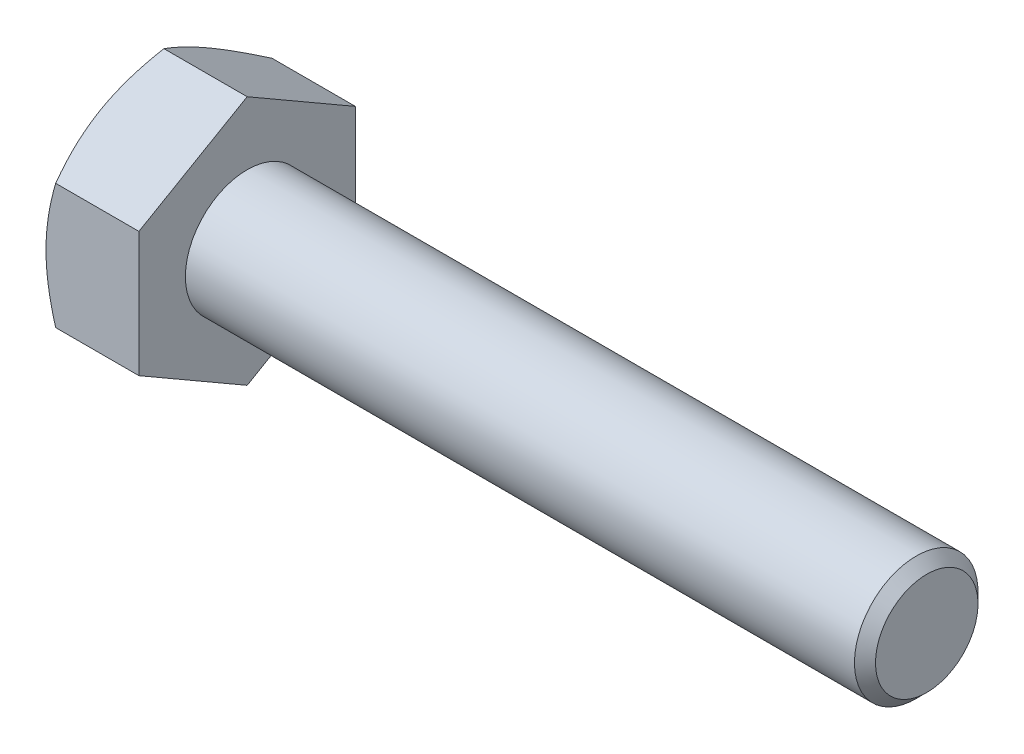
ISO-10303-21;
HEADER;
FILE_DESCRIPTION(('STEP AP214'),'2;1');
FILE_NAME('part.step','',(''),(''),'','','');
FILE_SCHEMA(('AUTOMOTIVE_DESIGN { 1 0 10303 214 1 1 1 1 }'));
ENDSEC;
DATA;
#1=APPLICATION_CONTEXT('core data for automotive mechanical design processes');
#2=APPLICATION_PROTOCOL_DEFINITION('international standard','automotive_design',2000,#1);
#3=PRODUCT_CONTEXT('',#1,'mechanical');
#4=PRODUCT('Part','Part','',(#3));
#5=PRODUCT_RELATED_PRODUCT_CATEGORY('part','',(#4));
#6=PRODUCT_DEFINITION_FORMATION('','',#4);
#7=PRODUCT_DEFINITION_CONTEXT('part definition',#1,'design');
#8=PRODUCT_DEFINITION('design','',#6,#7);
#9=PRODUCT_DEFINITION_SHAPE('','',#8);
#10=(LENGTH_UNIT() NAMED_UNIT(*) SI_UNIT(.MILLI.,.METRE.));
#11=(NAMED_UNIT(*) PLANE_ANGLE_UNIT() SI_UNIT($,.RADIAN.));
#12=(NAMED_UNIT(*) SI_UNIT($,.STERADIAN.) SOLID_ANGLE_UNIT());
#13=UNCERTAINTY_MEASURE_WITH_UNIT(LENGTH_MEASURE(1.E-05),#10,'distance_accuracy_value','');
#14=(GEOMETRIC_REPRESENTATION_CONTEXT(3) GLOBAL_UNCERTAINTY_ASSIGNED_CONTEXT((#13)) GLOBAL_UNIT_ASSIGNED_CONTEXT((#10,
#11,#12)) REPRESENTATION_CONTEXT('',''));
#15=CARTESIAN_POINT('',(0.,0.,0.));
#16=DIRECTION('',(0.,0.,1.));
#17=DIRECTION('',(1.,0.,0.));
#18=AXIS2_PLACEMENT_3D('',#15,#16,#17);
#19=CARTESIAN_POINT('',(4.7752,3.21156860739421,-5.5626));
#20=DIRECTION('',(0.,-0.866025403784438,0.500000000000001));
#21=DIRECTION('',(0.,-0.500000000000001,-0.866025403784438));
#22=AXIS2_PLACEMENT_3D('',#19,#20,#21);
#23=PLANE('',#22);
#24=CARTESIAN_POINT('',(0.496898061070143,6.42325268484227,0.0002));
#25=CARTESIAN_POINT('',(0.45614620225513,6.35265858120791,-0.122072574209491));
#26=CARTESIAN_POINT('',(0.417243775308723,6.2818012683745,-0.244801040124762));
#27=CARTESIAN_POINT('',(0.343647161560542,6.13951120287093,-0.491254662989243));
#28=CARTESIAN_POINT('',(0.308954790139044,6.06807821602765,-0.614980225538197));
#29=CARTESIAN_POINT('',(0.211873701066855,5.85263550648139,-0.98813794459262));
#30=CARTESIAN_POINT('',(0.156654841923373,5.70777535201369,-1.23904309212296));
#31=CARTESIAN_POINT('',(0.0919037861815275,5.49099476252075,-1.61451808721946));
#32=CARTESIAN_POINT('',(0.0734579983429333,5.41972205873199,-1.7379660313744));
#33=CARTESIAN_POINT('',(0.0425268916674615,5.27685459691414,-1.98541973399132));
#34=CARTESIAN_POINT('',(0.030041046189008,5.20525986790488,-2.10942544218948));
#35=CARTESIAN_POINT('',(0.0113480299394708,5.06194605565757,-2.35765224642821));
#36=CARTESIAN_POINT('',(0.00513373340584708,4.9902272065059,-2.48187293701928));
#37=CARTESIAN_POINT('',(-0.000889599359095551,4.84672720555795,-2.7304222295473));
#38=CARTESIAN_POINT('',(-0.000698833448296274,4.7749460557547,-2.85475082803225));
#39=CARTESIAN_POINT('',(0.00862810136342285,4.57828637012706,-3.19537539533985));
#40=CARTESIAN_POINT('',(0.0242873955350757,4.4534722013835,-3.41155987710816));
#41=CARTESIAN_POINT('',(0.0739443233816052,4.20467287416474,-3.84249295274001));
#42=CARTESIAN_POINT('',(0.107958931423458,4.08068859075412,-4.05724003094723));
#43=CARTESIAN_POINT('',(0.192986041409677,3.83138850679899,-4.4890404426887));
#44=CARTESIAN_POINT('',(0.244358813937401,3.70610416511176,-4.70603928788379));
#45=CARTESIAN_POINT('',(0.360954456999593,3.45740388365365,-5.13680081122592));
#46=CARTESIAN_POINT('',(0.426149937617058,3.33398475856357,-5.35056900650764));
#47=CARTESIAN_POINT('',(0.496898061070137,3.21145313734037,-5.5628));
#48=B_SPLINE_CURVE_WITH_KNOTS('',3,(#24,#25,#26,#27,#28,#29,#30,#31,#32,#33,#34,#35,#36,#37,#38,
#39,#40,#41,#42,#43,#44,#45,#46,#47),.UNSPECIFIED.,.F.,.F.,(4,2,2,2,2,2,2,2,2,2,2,4),(0.,
0.44082011856227,0.8818296488474,1.76568130465017,2.19678242164486,2.62784543796583,
3.05841812523868,3.48897751176353,4.23854798324166,4.98881282275669,5.75571809391027,
6.52111769989992),.UNSPECIFIED.);
#49=CARTESIAN_POINT('',(0.496831392605788,6.42313721478843,0.));
#50=VERTEX_POINT('',#49);
#51=CARTESIAN_POINT('',(0.,4.81735291109131,-2.78130000000001));
#52=VERTEX_POINT('',#51);
#53=EDGE_CURVE('E52',#50,#52,#48,.T.);
#54=ORIENTED_EDGE('',*,*,#53,.F.);
#55=DIRECTION('',(-1.,0.,0.));
#56=VECTOR('',#55,1.);
#57=CARTESIAN_POINT('',(4.7752,6.42313721478843,0.));
#58=LINE('',#57,#56);
#59=CARTESIAN_POINT('',(4.7752,6.42313721478843,0.));
#60=VERTEX_POINT('',#59);
#61=EDGE_CURVE('E148',#60,#50,#58,.T.);
#62=ORIENTED_EDGE('',*,*,#61,.F.);
#63=DIRECTION('',(0.,0.500000000000001,0.866025403784438));
#64=VECTOR('',#63,1.);
#65=CARTESIAN_POINT('',(4.7752,3.21156860739421,-5.5626));
#66=LINE('',#65,#64);
#67=CARTESIAN_POINT('',(4.7752,3.21156860739421,-5.5626));
#68=VERTEX_POINT('',#67);
#69=EDGE_CURVE('E239',#68,#60,#66,.T.);
#70=ORIENTED_EDGE('',*,*,#69,.F.);
#71=DIRECTION('',(-1.,0.,0.));
#72=VECTOR('',#71,1.);
#73=CARTESIAN_POINT('',(4.7752,3.21156860739421,-5.5626));
#74=LINE('',#73,#72);
#75=CARTESIAN_POINT('',(0.496831392605783,3.21156860739421,-5.5626));
#76=VERTEX_POINT('',#75);
#77=EDGE_CURVE('E136',#68,#76,#74,.T.);
#78=ORIENTED_EDGE('',*,*,#77,.T.);
#79=EDGE_CURVE('E130',#52,#76,#48,.T.);
#80=ORIENTED_EDGE('',*,*,#79,.F.);
#81=EDGE_LOOP('',(#54,#62,#70,#78,#80));
#82=FACE_BOUND('',#81,.T.);
#83=ADVANCED_FACE('F36',(#82),#23,.F.);
#84=CARTESIAN_POINT('',(4.7752,6.42313721478843,0.));
#85=DIRECTION('',(0.,-0.866025403784438,-0.500000000000001));
#86=DIRECTION('',(0.,0.500000000000001,-0.866025403784438));
#87=AXIS2_PLACEMENT_3D('',#84,#85,#86);
#88=PLANE('',#87);
#89=CARTESIAN_POINT('',(0.496898061070137,3.21145313734037,5.5628));
#90=CARTESIAN_POINT('',(0.456146202255125,3.28204724097473,5.44052742579051));
#91=CARTESIAN_POINT('',(0.417243775308718,3.35290455380814,5.31779895987524));
#92=CARTESIAN_POINT('',(0.343647161560538,3.49519461931171,5.07134533701076));
#93=CARTESIAN_POINT('',(0.30895479013904,3.56662760615498,4.9476197744618));
#94=CARTESIAN_POINT('',(0.211873701066851,3.78207031570124,4.57446205540738));
#95=CARTESIAN_POINT('',(0.15665484192337,3.92693047016895,4.32355690787704));
#96=CARTESIAN_POINT('',(0.0919037861815256,4.14371105966188,3.94808191278055));
#97=CARTESIAN_POINT('',(0.0734579983429316,4.21498376345064,3.82463396862561));
#98=CARTESIAN_POINT('',(0.0425268916674604,4.35785122526849,3.57718026600868));
#99=CARTESIAN_POINT('',(0.0300410461890073,4.42944595427775,3.45317455781052));
#100=CARTESIAN_POINT('',(0.0113480299394703,4.57275976652506,3.20494775357179));
#101=CARTESIAN_POINT('',(0.00513373340584622,4.64447861567673,3.08072706298073));
#102=CARTESIAN_POINT('',(-0.000889599359096195,4.78797861662468,2.8321777704527));
#103=CARTESIAN_POINT('',(-0.000698833448296402,4.85975976642794,2.70784917196775));
#104=CARTESIAN_POINT('',(0.00862810136342377,5.05641945205558,2.36722460466016));
#105=CARTESIAN_POINT('',(0.0242873955350769,5.18123362079913,2.15104012289184));
#106=CARTESIAN_POINT('',(0.0739443233816068,5.4300329480179,1.72010704725999));
#107=CARTESIAN_POINT('',(0.10795893142346,5.55401723142852,1.50535996905278));
#108=CARTESIAN_POINT('',(0.192986041409679,5.80331731538365,1.0735595573113));
#109=CARTESIAN_POINT('',(0.244358813937404,5.92860165707088,0.856560712116214));
#110=CARTESIAN_POINT('',(0.360954456999597,6.17730193852899,0.425799188774084));
#111=CARTESIAN_POINT('',(0.426149937617063,6.30072106361907,0.212030993492363));
#112=CARTESIAN_POINT('',(0.496898061070142,6.42325268484227,-0.000199999999999788));
#113=B_SPLINE_CURVE_WITH_KNOTS('',3,(#89,#90,#91,#92,#93,#94,#95,#96,#97,#98,#99,#100,#101,#102,
#103,#104,#105,#106,#107,#108,#109,#110,#111,#112),.UNSPECIFIED.,.F.,.F.,(4,2,2,2,2,2,2,2,2,2,2,
4),(0.,0.440820118562269,0.881829648847399,1.76568130465016,2.19678242164486,2.62784543796583,
3.05841812523867,3.48897751176352,4.23854798324166,4.98881282275669,5.75571809391027,
6.52111769989992),.UNSPECIFIED.);
#114=CARTESIAN_POINT('',(0.496831392605783,3.21156860739421,5.5626));
#115=VERTEX_POINT('',#114);
#116=CARTESIAN_POINT('',(0.,4.81735291109131,2.78130000000001));
#117=VERTEX_POINT('',#116);
#118=EDGE_CURVE('E59',#115,#117,#113,.T.);
#119=ORIENTED_EDGE('',*,*,#118,.F.);
#120=DIRECTION('',(-1.,0.,0.));
#121=VECTOR('',#120,1.);
#122=CARTESIAN_POINT('',(4.7752,3.21156860739421,5.5626));
#123=LINE('',#122,#121);
#124=CARTESIAN_POINT('',(4.7752,3.21156860739421,5.5626));
#125=VERTEX_POINT('',#124);
#126=EDGE_CURVE('E146',#125,#115,#123,.T.);
#127=ORIENTED_EDGE('',*,*,#126,.F.);
#128=DIRECTION('',(0.,-0.500000000000001,0.866025403784438));
#129=VECTOR('',#128,1.);
#130=CARTESIAN_POINT('',(4.7752,6.42313721478843,0.));
#131=LINE('',#130,#129);
#132=EDGE_CURVE('E237',#60,#125,#131,.T.);
#133=ORIENTED_EDGE('',*,*,#132,.F.);
#134=ORIENTED_EDGE('',*,*,#61,.T.);
#135=EDGE_CURVE('E163',#117,#50,#113,.T.);
#136=ORIENTED_EDGE('',*,*,#135,.F.);
#137=EDGE_LOOP('',(#119,#127,#133,#134,#136));
#138=FACE_BOUND('',#137,.T.);
#139=ADVANCED_FACE('F169',(#138),#88,.F.);
#140=CARTESIAN_POINT('',(4.7752,3.21156860739421,5.5626));
#141=DIRECTION('',(0.,0.,-1.));
#142=DIRECTION('',(0.,1.,0.));
#143=AXIS2_PLACEMENT_3D('',#140,#141,#142);
#144=PLANE('',#143);
#145=CARTESIAN_POINT('',(2.76946298118782,-8.73931907134927,5.5626));
#146=CARTESIAN_POINT('',(2.65067477687312,-8.49536496294497,5.5626));
#147=CARTESIAN_POINT('',(2.53299354297043,-8.25086273134793,5.5626));
#148=CARTESIAN_POINT('',(2.30046552320844,-7.76047089715342,5.5626));
#149=CARTESIAN_POINT('',(2.18561916316987,-7.5145810928649,5.5626));
#150=CARTESIAN_POINT('',(1.95882765602869,-7.01990967591009,5.5626));
#151=CARTESIAN_POINT('',(1.8469007539214,-6.77111967039447,5.5626));
#152=CARTESIAN_POINT('',(1.62748022369642,-6.27159952720681,5.5626));
#153=CARTESIAN_POINT('',(1.51998639326666,-6.02086947869408,5.5626));
#154=CARTESIAN_POINT('',(1.30708686305049,-5.50862062515996,5.5626));
#155=CARTESIAN_POINT('',(1.2018721345633,-5.24702202730585,5.5626));
#156=CARTESIAN_POINT('',(0.999136458565241,-4.72080610690396,5.5626));
#157=CARTESIAN_POINT('',(0.901616358276675,-4.45618845560252,5.5626));
#158=CARTESIAN_POINT('',(0.716747076854941,-3.92397402586808,5.5626));
#159=CARTESIAN_POINT('',(0.629378259627778,-3.65638413416905,5.5626));
#160=CARTESIAN_POINT('',(0.467540995367504,-3.11736467394693,5.5626));
#161=CARTESIAN_POINT('',(0.393068603844486,-2.84593630702824,5.5626));
#162=CARTESIAN_POINT('',(0.260913640576689,-2.3005952403753,5.5626));
#163=CARTESIAN_POINT('',(0.203137923933971,-2.0267054719603,5.5626));
#164=CARTESIAN_POINT('',(0.107584140993963,-1.47536640605574,5.5626));
#165=CARTESIAN_POINT('',(0.0698039298235418,-1.19791749361909,5.5626));
#166=CARTESIAN_POINT('',(0.0306329033129838,-0.782024037078659,5.5626));
#167=CARTESIAN_POINT('',(0.0205033244370692,-0.644369603517906,5.5626));
#168=CARTESIAN_POINT('',(0.00607539249484276,-0.368760084714105,5.5626));
#169=CARTESIAN_POINT('',(0.001776487806837,-0.23080502914899,5.5626));
#170=CARTESIAN_POINT('',(-0.000882415988902745,0.0451740110860421,5.5626));
#171=CARTESIAN_POINT('',(0.000758104200529315,0.183198000728097,5.5626));
#172=CARTESIAN_POINT('',(0.00993570123351525,0.459040077970901,5.5626));
#173=CARTESIAN_POINT('',(0.0174725517322422,0.596858173271936,5.5626));
#174=CARTESIAN_POINT('',(0.0422505226941692,0.924672766545142,5.5626));
#175=CARTESIAN_POINT('',(0.0620998981240959,1.11447655015001,5.5626));
#176=CARTESIAN_POINT('',(0.11192524345136,1.49274005777642,5.5626));
#177=CARTESIAN_POINT('',(0.141902492996071,1.68119960888145,5.5626));
#178=CARTESIAN_POINT('',(0.245441794558734,2.24430469004824,5.5626));
#179=CARTESIAN_POINT('',(0.332595181454098,2.61648783903803,5.5626));
#180=CARTESIAN_POINT('',(0.484580656688797,3.17327423069248,5.5626));
#181=CARTESIAN_POINT('',(0.539535147458609,3.36074033845108,5.5626));
#182=CARTESIAN_POINT('',(0.655361856953687,3.73385345225386,5.5626));
#183=CARTESIAN_POINT('',(0.716234120687404,3.91950044445068,5.5626));
#184=CARTESIAN_POINT('',(0.842902268347432,4.28903173945151,5.5626));
#185=CARTESIAN_POINT('',(0.908696733188394,4.47291653318726,5.5626));
#186=CARTESIAN_POINT('',(1.04441413237549,4.83914664715103,5.5626));
#187=CARTESIAN_POINT('',(1.11433697604312,5.02149200109188,5.5626));
#188=CARTESIAN_POINT('',(1.30616254116173,5.50788799936829,5.5626));
#189=CARTESIAN_POINT('',(1.43118964217263,5.81070521732176,5.5626));
#190=CARTESIAN_POINT('',(1.68847909791363,6.41326146392027,5.5626));
#191=CARTESIAN_POINT('',(1.82074222334613,6.71300016062079,5.5626));
#192=CARTESIAN_POINT('',(2.09080854329268,7.31009692856944,5.5626));
#193=CARTESIAN_POINT('',(2.22861377416229,7.60745407573434,5.5626));
#194=CARTESIAN_POINT('',(2.50845292532567,8.20015103027085,5.5626));
#195=CARTESIAN_POINT('',(2.65048668069894,8.4954909157686,5.5626));
#196=CARTESIAN_POINT('',(2.93809441051761,9.08501121024942,5.5626));
#197=CARTESIAN_POINT('',(3.08367358024025,9.37918907947536,5.5626));
#198=CARTESIAN_POINT('',(3.3774807874048,9.96621951539326,5.5626));
#199=CARTESIAN_POINT('',(3.52570884593012,10.2590720715133,5.5626));
#200=CARTESIAN_POINT('',(3.97349977739061,11.135883002068,5.5626));
#201=CARTESIAN_POINT('',(4.27623214013078,11.7182219913802,5.5626));
#202=CARTESIAN_POINT('',(4.85550678061973,12.8193647778852,5.5626));
#203=CARTESIAN_POINT('',(5.131489866857,13.3384641726992,5.5626));
#204=CARTESIAN_POINT('',(5.68680572725548,14.3749069841369,5.5626));
#205=CARTESIAN_POINT('',(5.96613869990832,14.8922502943533,5.5626));
#206=CARTESIAN_POINT('',(6.52636532569116,15.9238879354022,5.5626));
#207=CARTESIAN_POINT('',(6.80725082971984,16.438186698545,5.5626));
#208=CARTESIAN_POINT('',(7.37092859091902,17.465687215985,5.5626));
#209=CARTESIAN_POINT('',(7.65372069975336,17.9788890516247,5.5626));
#210=CARTESIAN_POINT('',(7.93720779447483,18.4917042756102,5.5626));
#211=B_SPLINE_CURVE_WITH_KNOTS('',3,(#145,#146,#147,#148,#149,#150,#151,#152,#153,#154,#155,
#156,#157,#158,#159,#160,#161,#162,#163,#164,#165,#166,#167,#168,#169,#170,#171,#172,#173,#174,
#175,#176,#177,#178,#179,#180,#181,#182,#183,#184,#185,#186,#187,#188,#189,#190,#191,#192,#193,
#194,#195,#196,#197,#198,#199,#200,#201,#202,#203,#204,#205,#206,#207,#208,#209,#210),
.UNSPECIFIED.,.F.,.F.,(4,2,2,2,2,2,2,2,2,2,2,2,2,2,2,2,2,2,2,2,2,2,2,2,2,2,2,2,2,2,2,2,4),(0.,
0.814023059457574,1.62816765666496,2.44655638570204,3.26490772451191,4.1107076400708,
4.95660055342857,5.80082897227975,6.64479871831149,7.4839651145243,8.32304147698215,
8.73701667946677,9.15095271433074,9.56492494141958,9.97888127796806,10.5510771655991,
11.1233453766966,12.2684477407956,12.8544603586944,13.4404774339429,14.0263262050101,
14.6121621128824,15.5948602729038,16.577663303757,17.5608308091096,18.5439600191606,
19.52862868616,20.5133051939663,22.4822323595086,24.2459312012703,26.0097350693917,
27.7677407284946,29.5256111556825),.UNSPECIFIED.);
#212=CARTESIAN_POINT('',(0.496831392605779,-3.21156860739419,5.5626));
#213=VERTEX_POINT('',#212);
#214=CARTESIAN_POINT('',(0.,0.,5.5626));
#215=VERTEX_POINT('',#214);
#216=EDGE_CURVE('E249',#213,#215,#211,.T.);
#217=ORIENTED_EDGE('',*,*,#216,.F.);
#218=DIRECTION('',(-1.,0.,0.));
#219=VECTOR('',#218,1.);
#220=CARTESIAN_POINT('',(4.7752,-3.21156860739419,5.5626));
#221=LINE('',#220,#219);
#222=CARTESIAN_POINT('',(4.7752,-3.21156860739419,5.5626));
#223=VERTEX_POINT('',#222);
#224=EDGE_CURVE('E138',#223,#213,#221,.T.);
#225=ORIENTED_EDGE('',*,*,#224,.F.);
#226=DIRECTION('',(0.,-1.,0.));
#227=VECTOR('',#226,1.);
#228=CARTESIAN_POINT('',(4.7752,3.21156860739421,5.5626));
#229=LINE('',#228,#227);
#230=EDGE_CURVE('E233',#125,#223,#229,.T.);
#231=ORIENTED_EDGE('',*,*,#230,.F.);
#232=ORIENTED_EDGE('',*,*,#126,.T.);
#233=EDGE_CURVE('E187',#215,#115,#211,.T.);
#234=ORIENTED_EDGE('',*,*,#233,.F.);
#235=EDGE_LOOP('',(#217,#225,#231,#232,#234));
#236=FACE_BOUND('',#235,.T.);
#237=ADVANCED_FACE('F255',(#236),#144,.F.);
#238=CARTESIAN_POINT('',(4.7752,-6.42313721478842,0.));
#239=DIRECTION('',(0.,0.866025403784438,-0.500000000000002));
#240=DIRECTION('',(0.,0.500000000000002,0.866025403784438));
#241=AXIS2_PLACEMENT_3D('',#238,#239,#240);
#242=PLANE('',#241);
#243=CARTESIAN_POINT('',(0.496898061070138,-6.42325268484226,-0.000200000000000038));
#244=CARTESIAN_POINT('',(0.456146202255126,-6.3526585812079,0.122072574209491));
#245=CARTESIAN_POINT('',(0.417243775308719,-6.28180126837449,0.244801040124762));
#246=CARTESIAN_POINT('',(0.343647161560538,-6.13951120287092,0.491254662989243));
#247=CARTESIAN_POINT('',(0.30895479013904,-6.06807821602765,0.614980225538197));
#248=CARTESIAN_POINT('',(0.21187370106685,-5.85263550648139,0.988137944592619));
#249=CARTESIAN_POINT('',(0.156654841923369,-5.70777535201368,1.23904309212296));
#250=CARTESIAN_POINT('',(0.0919037861815231,-5.49099476252075,1.61451808721945));
#251=CARTESIAN_POINT('',(0.0734579983429287,-5.41972205873199,1.73796603137439));
#252=CARTESIAN_POINT('',(0.0425268916674567,-5.27685459691413,1.98541973399132));
#253=CARTESIAN_POINT('',(0.0300410461890033,-5.20525986790488,2.10942544218948));
#254=CARTESIAN_POINT('',(0.0113480299394658,-5.06194605565756,2.35765224642821));
#255=CARTESIAN_POINT('',(0.00513373340584158,-4.99022720650589,2.48187293701927));
#256=CARTESIAN_POINT('',(-0.00088959935910106,-4.84672720555795,2.73042222954729));
#257=CARTESIAN_POINT('',(-0.000698833448301401,-4.77494605575469,2.85475082803225));
#258=CARTESIAN_POINT('',(0.00862810136341809,-4.57828637012705,3.19537539533984));
#259=CARTESIAN_POINT('',(0.0242873955350705,-4.45347220138349,3.41155987710816));
#260=CARTESIAN_POINT('',(0.0739443233815994,-4.20467287416473,3.84249295274001));
#261=CARTESIAN_POINT('',(0.107958931423452,-4.08068859075411,4.05724003094722));
#262=CARTESIAN_POINT('',(0.192986041409671,-3.83138850679897,4.48904044268869));
#263=CARTESIAN_POINT('',(0.244358813937396,-3.70610416511175,4.70603928788379));
#264=CARTESIAN_POINT('',(0.360954456999589,-3.45740388365364,5.13680081122591));
#265=CARTESIAN_POINT('',(0.426149937617054,-3.33398475856356,5.35056900650764));
#266=CARTESIAN_POINT('',(0.496898061070133,-3.21145313734036,5.5628));
#267=B_SPLINE_CURVE_WITH_KNOTS('',3,(#243,#244,#245,#246,#247,#248,#249,#250,#251,#252,#253,
#254,#255,#256,#257,#258,#259,#260,#261,#262,#263,#264,#265,#266),.UNSPECIFIED.,.F.,.F.,(4,2,2,
2,2,2,2,2,2,2,2,4),(0.,0.44082011856227,0.881829648847399,1.76568130465016,2.19678242164486,
2.62784543796583,3.05841812523868,3.48897751176352,4.23854798324166,4.98881282275669,
5.75571809391028,6.52111769989993),.UNSPECIFIED.);
#268=CARTESIAN_POINT('',(0.496831392605783,-6.42313721478842,0.));
#269=VERTEX_POINT('',#268);
#270=CARTESIAN_POINT('',(0.,-4.81735291109131,2.78130000000001));
#271=VERTEX_POINT('',#270);
#272=EDGE_CURVE('E171',#269,#271,#267,.T.);
#273=ORIENTED_EDGE('',*,*,#272,.F.);
#274=DIRECTION('',(-1.,0.,0.));
#275=VECTOR('',#274,1.);
#276=CARTESIAN_POINT('',(4.7752,-6.42313721478842,0.));
#277=LINE('',#276,#275);
#278=CARTESIAN_POINT('',(4.7752,-6.42313721478842,0.));
#279=VERTEX_POINT('',#278);
#280=EDGE_CURVE('E135',#279,#269,#277,.T.);
#281=ORIENTED_EDGE('',*,*,#280,.F.);
#282=DIRECTION('',(0.,-0.500000000000002,-0.866025403784438));
#283=VECTOR('',#282,1.);
#284=CARTESIAN_POINT('',(4.7752,-6.42313721478842,0.));
#285=LINE('',#284,#283);
#286=EDGE_CURVE('E231',#223,#279,#285,.T.);
#287=ORIENTED_EDGE('',*,*,#286,.F.);
#288=ORIENTED_EDGE('',*,*,#224,.T.);
#289=EDGE_CURVE('E173',#271,#213,#267,.T.);
#290=ORIENTED_EDGE('',*,*,#289,.F.);
#291=EDGE_LOOP('',(#273,#281,#287,#288,#290));
#292=FACE_BOUND('',#291,.T.);
#293=ADVANCED_FACE('F227',(#292),#242,.F.);
#294=CARTESIAN_POINT('',(4.7752,-3.21156860739422,-5.5626));
#295=DIRECTION('',(0.,0.866025403784439,0.499999999999999));
#296=DIRECTION('',(0.,-0.499999999999999,0.866025403784439));
#297=AXIS2_PLACEMENT_3D('',#294,#295,#296);
#298=PLANE('',#297);
#299=CARTESIAN_POINT('',(0.49689806107014,-3.21145313734038,-5.5628));
#300=CARTESIAN_POINT('',(0.456146202255128,-3.28204724097474,-5.44052742579051));
#301=CARTESIAN_POINT('',(0.417243775308721,-3.35290455380815,-5.31779895987524));
#302=CARTESIAN_POINT('',(0.343647161560541,-3.49519461931171,-5.07134533701076));
#303=CARTESIAN_POINT('',(0.308954790139042,-3.56662760615499,-4.9476197744618));
#304=CARTESIAN_POINT('',(0.211873701066853,-3.78207031570125,-4.57446205540738));
#305=CARTESIAN_POINT('',(0.156654841923372,-3.92693047016895,-4.32355690787704));
#306=CARTESIAN_POINT('',(0.0919037861815272,-4.14371105966189,-3.94808191278054));
#307=CARTESIAN_POINT('',(0.0734579983429331,-4.21498376345065,-3.8246339686256));
#308=CARTESIAN_POINT('',(0.0425268916674613,-4.3578512252685,-3.57718026600868));
#309=CARTESIAN_POINT('',(0.0300410461890077,-4.42944595427776,-3.45317455781052));
#310=CARTESIAN_POINT('',(0.0113480299394704,-4.57275976652507,-3.20494775357179));
#311=CARTESIAN_POINT('',(0.00513373340584659,-4.64447861567674,-3.08072706298072));
#312=CARTESIAN_POINT('',(-0.000889599359095559,-4.78797861662469,-2.8321777704527));
#313=CARTESIAN_POINT('',(-0.000698833448295763,-4.85975976642794,-2.70784917196775));
#314=CARTESIAN_POINT('',(0.00862810136342402,-5.05641945205558,-2.36722460466015));
#315=CARTESIAN_POINT('',(0.0242873955350764,-5.18123362079914,-2.15104012289184));
#316=CARTESIAN_POINT('',(0.0739443233816055,-5.4300329480179,-1.72010704725999));
#317=CARTESIAN_POINT('',(0.107958931423458,-5.55401723142852,-1.50535996905277));
#318=CARTESIAN_POINT('',(0.192986041409677,-5.80331731538365,-1.0735595573113));
#319=CARTESIAN_POINT('',(0.244358813937401,-5.92860165707087,-0.856560712116213));
#320=CARTESIAN_POINT('',(0.360954456999593,-6.17730193852898,-0.425799188774084));
#321=CARTESIAN_POINT('',(0.426149937617058,-6.30072106361906,-0.212030993492364));
#322=CARTESIAN_POINT('',(0.496898061070137,-6.42325268484226,0.000199999999999785));
#323=B_SPLINE_CURVE_WITH_KNOTS('',3,(#299,#300,#301,#302,#303,#304,#305,#306,#307,#308,#309,
#310,#311,#312,#313,#314,#315,#316,#317,#318,#319,#320,#321,#322),.UNSPECIFIED.,.F.,.F.,(4,2,2,
2,2,2,2,2,2,2,2,4),(0.,0.44082011856227,0.881829648847399,1.76568130465016,2.19678242164486,
2.62784543796583,3.05841812523868,3.48897751176353,4.23854798324166,4.98881282275669,
5.75571809391027,6.52111769989992),.UNSPECIFIED.);
#324=CARTESIAN_POINT('',(0.496831392605577,-3.21156860739453,-5.5626));
#325=VERTEX_POINT('',#324);
#326=CARTESIAN_POINT('',(0.,-4.81735291109132,-2.7813));
#327=VERTEX_POINT('',#326);
#328=EDGE_CURVE('E112',#325,#327,#323,.T.);
#329=ORIENTED_EDGE('',*,*,#328,.F.);
#330=DIRECTION('',(-1.,0.,0.));
#331=VECTOR('',#330,1.);
#332=CARTESIAN_POINT('',(4.7752,-3.21156860739422,-5.5626));
#333=LINE('',#332,#331);
#334=CARTESIAN_POINT('',(4.7752,-3.21156860739422,-5.5626));
#335=VERTEX_POINT('',#334);
#336=EDGE_CURVE('E126',#335,#325,#333,.T.);
#337=ORIENTED_EDGE('',*,*,#336,.F.);
#338=DIRECTION('',(0.,0.499999999999999,-0.866025403784439));
#339=VECTOR('',#338,1.);
#340=CARTESIAN_POINT('',(4.7752,-3.21156860739422,-5.5626));
#341=LINE('',#340,#339);
#342=EDGE_CURVE('E229',#279,#335,#341,.T.);
#343=ORIENTED_EDGE('',*,*,#342,.F.);
#344=ORIENTED_EDGE('',*,*,#280,.T.);
#345=EDGE_CURVE('E129',#327,#269,#323,.T.);
#346=ORIENTED_EDGE('',*,*,#345,.F.);
#347=EDGE_LOOP('',(#329,#337,#343,#344,#346));
#348=FACE_BOUND('',#347,.T.);
#349=ADVANCED_FACE('F124',(#348),#298,.F.);
#350=CARTESIAN_POINT('',(4.7752,3.21156860739421,-5.5626));
#351=DIRECTION('',(0.,0.,1.));
#352=DIRECTION('',(0.,-1.,0.));
#353=AXIS2_PLACEMENT_3D('',#350,#351,#352);
#354=PLANE('',#353);
#355=CARTESIAN_POINT('',(2.76946298300579,-8.73931907508182,-5.5626));
#356=CARTESIAN_POINT('',(2.65067477861528,-8.49536496655187,-5.5626));
#357=CARTESIAN_POINT('',(2.53299354463683,-8.25086273482909,-5.5626));
#358=CARTESIAN_POINT('',(2.30046552472368,-7.76047090038273,-5.5626));
#359=CARTESIAN_POINT('',(2.18561916460973,-7.51458109596809,-5.5626));
#360=CARTESIAN_POINT('',(1.95882765731771,-7.01990967875913,-5.5626));
#361=CARTESIAN_POINT('',(1.846900755135,-6.77111967311548,-5.5626));
#362=CARTESIAN_POINT('',(1.62748022476042,-6.27159952967089,-5.5626));
#363=CARTESIAN_POINT('',(1.51998639425648,-6.02086948102925,-5.5626));
#364=CARTESIAN_POINT('',(1.30708686388975,-5.50862062722724,-5.5626));
#365=CARTESIAN_POINT('',(1.20187213532635,-5.24702202923406,-5.5626));
#366=CARTESIAN_POINT('',(0.999136459179921,-4.72080610855179,-5.5626));
#367=CARTESIAN_POINT('',(0.901616358819192,-4.45618845710904,-5.5626));
#368=CARTESIAN_POINT('',(0.716747077259989,-3.92397402708938,-5.5626));
#369=CARTESIAN_POINT('',(0.629378259967502,-3.65638413524644,-5.5626));
#370=CARTESIAN_POINT('',(0.467540995587167,-3.11736467473259,-5.5626));
#371=CARTESIAN_POINT('',(0.393068604009408,-2.84593630766609,-5.5626));
#372=CARTESIAN_POINT('',(0.260913640631061,-2.3005952406421,-5.5626));
#373=CARTESIAN_POINT('',(0.203137923936715,-2.02670547200286,-5.5626));
#374=CARTESIAN_POINT('',(0.107584140927261,-1.47536640564425,-5.5626));
#375=CARTESIAN_POINT('',(0.0698039297389959,-1.19791749297779,-5.5626));
#376=CARTESIAN_POINT('',(0.0306329032322217,-0.782024036094228,-5.5626));
#377=CARTESIAN_POINT('',(0.0205033243625259,-0.644369602420759,-5.5626));
#378=CARTESIAN_POINT('',(0.00607539244269882,-0.368760083391737,-5.5626));
#379=CARTESIAN_POINT('',(0.00177648777087202,-0.230805027714119,-5.5626));
#380=CARTESIAN_POINT('',(-0.000882415982738997,0.0451740127451205,-5.5626));
#381=CARTESIAN_POINT('',(0.000758104232646156,0.183198002498878,-5.5626));
#382=CARTESIAN_POINT('',(0.00993570132662356,0.459040079963614,-5.5626));
#383=CARTESIAN_POINT('',(0.0174725518603882,0.596858175374879,-5.5626));
#384=CARTESIAN_POINT('',(0.0422505229084564,0.924672768817529,-5.5626));
#385=CARTESIAN_POINT('',(0.0620998983879045,1.11447655248113,-5.5626));
#386=CARTESIAN_POINT('',(0.111925243816849,1.49274006022233,-5.5626));
#387=CARTESIAN_POINT('',(0.141902493413719,1.6811996113834,-5.5626));
#388=CARTESIAN_POINT('',(0.245441795133936,2.24430469271526,-5.5626));
#389=CARTESIAN_POINT('',(0.332595182135701,2.61648784181073,-5.5626));
#390=CARTESIAN_POINT('',(0.484580657527369,3.17327423362326,-5.5626));
#391=CARTESIAN_POINT('',(0.539535148349865,3.36074034143568,-5.5626));
#392=CARTESIAN_POINT('',(0.655361857948679,3.7338534553455,-5.5626));
#393=CARTESIAN_POINT('',(0.716234121733449,3.91950044759555,-5.5626));
#394=CARTESIAN_POINT('',(0.842902269493736,4.28903174270241,-5.5626));
#395=CARTESIAN_POINT('',(0.908696734383899,4.47291653649097,-5.5626));
#396=CARTESIAN_POINT('',(1.04441413366767,4.83914665056038,-5.5626));
#397=CARTESIAN_POINT('',(1.11433697738277,5.02149200455406,-5.5626));
#398=CARTESIAN_POINT('',(1.30616254258248,5.5078880028608,-5.5626));
#399=CARTESIAN_POINT('',(1.43118964362202,5.81070522079329,-5.5626));
#400=CARTESIAN_POINT('',(1.68847909941208,6.41326146735254,-5.5626));
#401=CARTESIAN_POINT('',(1.82074222486501,6.71300016403479,-5.5626));
#402=CARTESIAN_POINT('',(2.09080854484644,7.31009693194881,-5.5626));
#403=CARTESIAN_POINT('',(2.22861377573049,7.60745407909738,-5.5626));
#404=CARTESIAN_POINT('',(2.50845292691854,8.20015103360298,-5.5626));
#405=CARTESIAN_POINT('',(2.65048668230202,8.49549091908616,-5.5626));
#406=CARTESIAN_POINT('',(2.93809441213761,9.08501121353829,-5.5626));
#407=CARTESIAN_POINT('',(3.08367358186692,9.37918908275011,-5.5626));
#408=CARTESIAN_POINT('',(3.37748078904248,9.96621951864084,-5.5626));
#409=CARTESIAN_POINT('',(3.52570884757214,10.2590720747478,-5.5626));
#410=CARTESIAN_POINT('',(3.97349977904316,11.1358830052649,-5.5626));
#411=CARTESIAN_POINT('',(4.27623214178691,11.7182219945536,-5.5626));
#412=CARTESIAN_POINT('',(4.8555067822888,12.8193647810355,-5.5626));
#413=CARTESIAN_POINT('',(5.13148986853601,13.3384641758492,-5.5626));
#414=CARTESIAN_POINT('',(5.68680572895232,14.3749069872875,-5.5626));
#415=CARTESIAN_POINT('',(5.96613870161306,14.8922502975047,-5.5626));
#416=CARTESIAN_POINT('',(6.52636532741208,15.9238879385591,-5.5626));
#417=CARTESIAN_POINT('',(6.80725083144907,16.4381867017065,-5.5626));
#418=CARTESIAN_POINT('',(7.37092859266394,17.4656872191565,-5.5626));
#419=CARTESIAN_POINT('',(7.65372070150567,17.9788890548015,-5.5626));
#420=CARTESIAN_POINT('',(7.93720779623422,18.4917042787924,-5.5626));
#421=B_SPLINE_CURVE_WITH_KNOTS('',3,(#355,#356,#357,#358,#359,#360,#361,#362,#363,#364,#365,
#366,#367,#368,#369,#370,#371,#372,#373,#374,#375,#376,#377,#378,#379,#380,#381,#382,#383,#384,
#385,#386,#387,#388,#389,#390,#391,#392,#393,#394,#395,#396,#397,#398,#399,#400,#401,#402,#403,
#404,#405,#406,#407,#408,#409,#410,#411,#412,#413,#414,#415,#416,#417,#418,#419,#420),
.UNSPECIFIED.,.F.,.F.,(4,2,2,2,2,2,2,2,2,2,2,2,2,2,2,2,2,2,2,2,2,2,2,2,2,2,2,2,2,2,2,2,4),(0.,
0.814023059896039,1.62816765754195,2.44655638702216,3.26490772627512,4.11070764230638,
4.95660055613668,5.80082897545884,6.6447987219612,7.48396511886283,8.32304148200849,
8.7370166848287,9.15095272002818,9.56492494745272,9.97888128433688,10.5510771721585,
11.1233453834466,12.2684477479276,12.8544603660259,13.4404774414739,14.0263262127401,
14.6121621208114,15.5948602808078,16.5776633116356,17.5608308169621,18.5439600269871,
19.5286286939574,20.5133052017346,22.4822323672198,24.245931208995,26.0097350771296,
27.7677407362569,29.5256111634693),.UNSPECIFIED.);
#422=CARTESIAN_POINT('',(0.,0.,-5.5626));
#423=VERTEX_POINT('',#422);
#424=EDGE_CURVE('E118',#76,#423,#421,.F.);
#425=ORIENTED_EDGE('',*,*,#424,.F.);
#426=ORIENTED_EDGE('',*,*,#77,.F.);
#427=DIRECTION('',(0.,1.,0.));
#428=VECTOR('',#427,1.);
#429=CARTESIAN_POINT('',(4.7752,3.21156860739421,-5.5626));
#430=LINE('',#429,#428);
#431=EDGE_CURVE('E134',#335,#68,#430,.T.);
#432=ORIENTED_EDGE('',*,*,#431,.F.);
#433=ORIENTED_EDGE('',*,*,#336,.T.);
#434=EDGE_CURVE('E109',#423,#325,#421,.F.);
#435=ORIENTED_EDGE('',*,*,#434,.F.);
#436=EDGE_LOOP('',(#425,#426,#432,#433,#435));
#437=FACE_BOUND('',#436,.T.);
#438=ADVANCED_FACE('F132',(#437),#354,.F.);
#439=CARTESIAN_POINT('',(4.7752,6.42313721478843,0.));
#440=DIRECTION('',(1.,0.,0.));
#441=DIRECTION('',(0.,0.,-1.));
#442=AXIS2_PLACEMENT_3D('',#439,#440,#441);
#443=PLANE('',#442);
#444=CARTESIAN_POINT('',(4.7752,0.,0.));
#445=DIRECTION('',(1.,0.,0.));
#446=DIRECTION('',(0.,0.,-1.));
#447=AXIS2_PLACEMENT_3D('',#444,#445,#446);
#448=CIRCLE('',#447,3.175);
#449=CARTESIAN_POINT('',(4.7752,0.,-3.175));
#450=VERTEX_POINT('',#449);
#451=EDGE_CURVE('E242',#450,#450,#448,.F.);
#452=ORIENTED_EDGE('',*,*,#451,.T.);
#453=EDGE_LOOP('',(#452));
#454=FACE_BOUND('',#453,.T.);
#455=ORIENTED_EDGE('',*,*,#69,.T.);
#456=ORIENTED_EDGE('',*,*,#132,.T.);
#457=ORIENTED_EDGE('',*,*,#230,.T.);
#458=ORIENTED_EDGE('',*,*,#286,.T.);
#459=ORIENTED_EDGE('',*,*,#342,.T.);
#460=ORIENTED_EDGE('',*,*,#431,.T.);
#461=EDGE_LOOP('',(#455,#456,#457,#458,#459,#460));
#462=FACE_BOUND('',#461,.T.);
#463=ADVANCED_FACE('F257',(#454,#462),#443,.T.);
#464=CARTESIAN_POINT('',(0.,0.,0.));
#465=DIRECTION('',(-1.,0.,0.));
#466=DIRECTION('',(0.,0.,1.));
#467=AXIS2_PLACEMENT_3D('',#464,#465,#466);
#468=CYLINDRICAL_SURFACE('',#467,3.175);
#469=ORIENTED_EDGE('',*,*,#451,.F.);
#470=EDGE_LOOP('',(#469));
#471=FACE_BOUND('',#470,.T.);
#472=CARTESIAN_POINT('',(39.15918,0.,0.));
#473=DIRECTION('',(-1.,0.,0.));
#474=DIRECTION('',(0.,0.,1.));
#475=AXIS2_PLACEMENT_3D('',#472,#473,#474);
#476=CIRCLE('',#475,3.175);
#477=CARTESIAN_POINT('',(39.15918,0.,3.175));
#478=VERTEX_POINT('',#477);
#479=EDGE_CURVE('E245',#478,#478,#476,.T.);
#480=ORIENTED_EDGE('',*,*,#479,.T.);
#481=EDGE_LOOP('',(#480));
#482=FACE_BOUND('',#481,.T.);
#483=ADVANCED_FACE('F288',(#471,#482),#468,.T.);
#484=CARTESIAN_POINT('',(39.7002,0.,0.));
#485=DIRECTION('',(-1.,0.,0.));
#486=DIRECTION('',(0.,0.,1.));
#487=AXIS2_PLACEMENT_3D('',#484,#485,#486);
#488=CONICAL_SURFACE('',#487,2.63398,0.785398163397446);
#489=ORIENTED_EDGE('',*,*,#479,.F.);
#490=EDGE_LOOP('',(#489));
#491=FACE_BOUND('',#490,.T.);
#492=CARTESIAN_POINT('',(39.7002,0.,0.));
#493=DIRECTION('',(-1.,0.,0.));
#494=DIRECTION('',(0.,0.,1.));
#495=AXIS2_PLACEMENT_3D('',#492,#493,#494);
#496=CIRCLE('',#495,2.63398);
#497=CARTESIAN_POINT('',(39.7002,0.,2.63398));
#498=VERTEX_POINT('',#497);
#499=EDGE_CURVE('E247',#498,#498,#496,.T.);
#500=ORIENTED_EDGE('',*,*,#499,.T.);
#501=EDGE_LOOP('',(#500));
#502=FACE_BOUND('',#501,.T.);
#503=ADVANCED_FACE('F291',(#491,#502),#488,.T.);
#504=CARTESIAN_POINT('',(39.7002,0.,0.));
#505=DIRECTION('',(-1.,0.,0.));
#506=DIRECTION('',(0.,0.,1.));
#507=AXIS2_PLACEMENT_3D('',#504,#505,#506);
#508=PLANE('',#507);
#509=ORIENTED_EDGE('',*,*,#499,.F.);
#510=EDGE_LOOP('',(#509));
#511=FACE_BOUND('',#510,.T.);
#512=ADVANCED_FACE('F201',(#511),#508,.F.);
#513=CARTESIAN_POINT('',(0.,0.,0.));
#514=DIRECTION('',(1.,0.,0.));
#515=DIRECTION('',(0.,0.,-1.));
#516=AXIS2_PLACEMENT_3D('',#513,#514,#515);
#517=CONICAL_SURFACE('',#516,5.5626,1.0471975511966);
#518=ORIENTED_EDGE('',*,*,#328,.T.);
#519=CARTESIAN_POINT('',(0.,0.,0.));
#520=DIRECTION('',(1.,0.,0.));
#521=DIRECTION('',(0.,0.,-1.));
#522=AXIS2_PLACEMENT_3D('',#519,#520,#521);
#523=CIRCLE('',#522,5.5626);
#524=EDGE_CURVE('E40',#327,#423,#523,.T.);
#525=ORIENTED_EDGE('',*,*,#524,.T.);
#526=ORIENTED_EDGE('',*,*,#434,.T.);
#527=EDGE_LOOP('',(#518,#525,#526));
#528=FACE_BOUND('',#527,.T.);
#529=ADVANCED_FACE('F111',(#528),#517,.T.);
#530=ORIENTED_EDGE('',*,*,#272,.T.);
#531=EDGE_CURVE('E153',#271,#327,#523,.T.);
#532=ORIENTED_EDGE('',*,*,#531,.T.);
#533=ORIENTED_EDGE('',*,*,#345,.T.);
#534=EDGE_LOOP('',(#530,#532,#533));
#535=FACE_BOUND('',#534,.T.);
#536=ADVANCED_FACE('F200',(#535),#517,.T.);
#537=ORIENTED_EDGE('',*,*,#216,.T.);
#538=EDGE_CURVE('E154',#215,#271,#523,.T.);
#539=ORIENTED_EDGE('',*,*,#538,.T.);
#540=ORIENTED_EDGE('',*,*,#289,.T.);
#541=EDGE_LOOP('',(#537,#539,#540));
#542=FACE_BOUND('',#541,.T.);
#543=ADVANCED_FACE('F195',(#542),#517,.T.);
#544=ORIENTED_EDGE('',*,*,#233,.T.);
#545=ORIENTED_EDGE('',*,*,#118,.T.);
#546=CARTESIAN_POINT('',(0.,0.,0.));
#547=DIRECTION('',(-1.,0.,0.));
#548=DIRECTION('',(0.,0.,1.));
#549=AXIS2_PLACEMENT_3D('',#546,#547,#548);
#550=CIRCLE('',#549,5.5626);
#551=EDGE_CURVE('E119',#215,#117,#550,.T.);
#552=ORIENTED_EDGE('',*,*,#551,.F.);
#553=EDGE_LOOP('',(#544,#545,#552));
#554=FACE_BOUND('',#553,.T.);
#555=ADVANCED_FACE('F199',(#554),#517,.T.);
#556=ORIENTED_EDGE('',*,*,#135,.T.);
#557=ORIENTED_EDGE('',*,*,#53,.T.);
#558=EDGE_CURVE('E45',#52,#117,#523,.T.);
#559=ORIENTED_EDGE('',*,*,#558,.T.);
#560=EDGE_LOOP('',(#556,#557,#559));
#561=FACE_BOUND('',#560,.T.);
#562=ADVANCED_FACE('F162',(#561),#517,.T.);
#563=ORIENTED_EDGE('',*,*,#79,.T.);
#564=ORIENTED_EDGE('',*,*,#424,.T.);
#565=EDGE_CURVE('E11',#423,#52,#523,.T.);
#566=ORIENTED_EDGE('',*,*,#565,.T.);
#567=EDGE_LOOP('',(#563,#564,#566));
#568=FACE_BOUND('',#567,.T.);
#569=ADVANCED_FACE('F260',(#568),#517,.T.);
#570=CARTESIAN_POINT('',(0.,6.42313721478843,0.));
#571=DIRECTION('',(1.,0.,0.));
#572=DIRECTION('',(0.,0.,-1.));
#573=AXIS2_PLACEMENT_3D('',#570,#571,#572);
#574=PLANE('',#573);
#575=ORIENTED_EDGE('',*,*,#565,.F.);
#576=ORIENTED_EDGE('',*,*,#524,.F.);
#577=ORIENTED_EDGE('',*,*,#531,.F.);
#578=ORIENTED_EDGE('',*,*,#538,.F.);
#579=ORIENTED_EDGE('',*,*,#551,.T.);
#580=ORIENTED_EDGE('',*,*,#558,.F.);
#581=EDGE_LOOP('',(#575,#576,#577,#578,#579,#580));
#582=FACE_BOUND('',#581,.T.);
#583=ADVANCED_FACE('F166',(#582),#574,.F.);
#584=CLOSED_SHELL('',(#83,#139,#237,#293,#349,#438,#463,#483,#503,#512,#529,#536,#543,#555,#562,
#569,#583));
#585=MANIFOLD_SOLID_BREP('B2',#584);
#586=ADVANCED_BREP_SHAPE_REPRESENTATION('',(#18,#585),#14);
#587=SHAPE_DEFINITION_REPRESENTATION(#9,#586);
ENDSEC;
END-ISO-10303-21;
